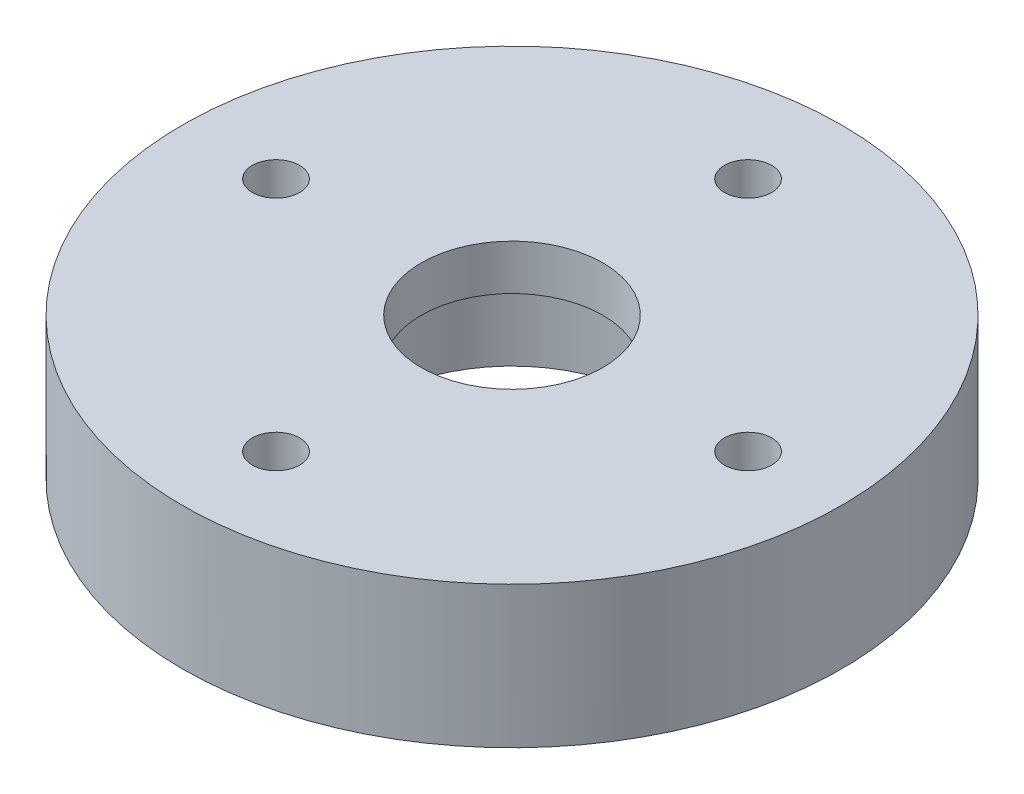
ISO-10303-21;
HEADER;
FILE_DESCRIPTION(('STEP AP214'),'2;1');
FILE_NAME('part.step','',(''),(''),'','','');
FILE_SCHEMA(('AUTOMOTIVE_DESIGN { 1 0 10303 214 1 1 1 1 }'));
ENDSEC;
DATA;
#1=APPLICATION_CONTEXT('core data for automotive mechanical design processes');
#2=APPLICATION_PROTOCOL_DEFINITION('international standard','automotive_design',2000,#1);
#3=PRODUCT_CONTEXT('',#1,'mechanical');
#4=PRODUCT('Part','Part','',(#3));
#5=PRODUCT_RELATED_PRODUCT_CATEGORY('part','',(#4));
#6=PRODUCT_DEFINITION_FORMATION('','',#4);
#7=PRODUCT_DEFINITION_CONTEXT('part definition',#1,'design');
#8=PRODUCT_DEFINITION('design','',#6,#7);
#9=PRODUCT_DEFINITION_SHAPE('','',#8);
#10=(LENGTH_UNIT() NAMED_UNIT(*) SI_UNIT(.MILLI.,.METRE.));
#11=(NAMED_UNIT(*) PLANE_ANGLE_UNIT() SI_UNIT($,.RADIAN.));
#12=(NAMED_UNIT(*) SI_UNIT($,.STERADIAN.) SOLID_ANGLE_UNIT());
#13=UNCERTAINTY_MEASURE_WITH_UNIT(LENGTH_MEASURE(1.E-05),#10,'distance_accuracy_value','');
#14=(GEOMETRIC_REPRESENTATION_CONTEXT(3) GLOBAL_UNCERTAINTY_ASSIGNED_CONTEXT((#13)) GLOBAL_UNIT_ASSIGNED_CONTEXT((#10,
#11,#12)) REPRESENTATION_CONTEXT('',''));
#15=CARTESIAN_POINT('',(0.,0.,0.));
#16=DIRECTION('',(0.,0.,1.));
#17=DIRECTION('',(1.,0.,0.));
#18=AXIS2_PLACEMENT_3D('',#15,#16,#17);
#19=CARTESIAN_POINT('',(0.,0.,0.));
#20=DIRECTION('',(0.,1.,0.));
#21=DIRECTION('',(0.,0.,1.));
#22=AXIS2_PLACEMENT_3D('',#19,#20,#21);
#23=PLANE('',#22);
#24=CARTESIAN_POINT('',(0.,0.,13.));
#25=DIRECTION('',(0.,1.,0.));
#26=DIRECTION('',(0.,0.,-1.));
#27=AXIS2_PLACEMENT_3D('',#24,#25,#26);
#28=CIRCLE('',#27,1.3);
#29=CARTESIAN_POINT('',(0.,0.,11.7));
#30=VERTEX_POINT('',#29);
#31=EDGE_CURVE('E70',#30,#30,#28,.T.);
#32=ORIENTED_EDGE('',*,*,#31,.T.);
#33=EDGE_LOOP('',(#32));
#34=FACE_BOUND('',#33,.T.);
#35=CARTESIAN_POINT('',(-13.,0.,-1.36167772214882E-13));
#36=DIRECTION('',(0.,1.,0.));
#37=DIRECTION('',(1.,0.,0.));
#38=AXIS2_PLACEMENT_3D('',#35,#36,#37);
#39=CIRCLE('',#38,1.3);
#40=CARTESIAN_POINT('',(-11.7,0.,-1.22550994993394E-13));
#41=VERTEX_POINT('',#40);
#42=EDGE_CURVE('E76',#41,#41,#39,.T.);
#43=ORIENTED_EDGE('',*,*,#42,.T.);
#44=EDGE_LOOP('',(#43));
#45=FACE_BOUND('',#44,.T.);
#46=CARTESIAN_POINT('',(13.,0.,0.));
#47=DIRECTION('',(0.,1.,0.));
#48=DIRECTION('',(-1.,0.,0.));
#49=AXIS2_PLACEMENT_3D('',#46,#47,#48);
#50=CIRCLE('',#49,1.3);
#51=CARTESIAN_POINT('',(11.7,0.,0.));
#52=VERTEX_POINT('',#51);
#53=EDGE_CURVE('E64',#52,#52,#50,.T.);
#54=ORIENTED_EDGE('',*,*,#53,.T.);
#55=EDGE_LOOP('',(#54));
#56=FACE_BOUND('',#55,.T.);
#57=CARTESIAN_POINT('',(0.,0.,-13.));
#58=DIRECTION('',(0.,1.,0.));
#59=DIRECTION('',(0.,0.,1.));
#60=AXIS2_PLACEMENT_3D('',#57,#58,#59);
#61=CIRCLE('',#60,1.3);
#62=CARTESIAN_POINT('',(0.,0.,-11.7));
#63=VERTEX_POINT('',#62);
#64=EDGE_CURVE('E58',#63,#63,#61,.T.);
#65=ORIENTED_EDGE('',*,*,#64,.T.);
#66=EDGE_LOOP('',(#65));
#67=FACE_BOUND('',#66,.T.);
#68=CARTESIAN_POINT('',(0.,0.,0.));
#69=DIRECTION('',(0.,1.,0.));
#70=DIRECTION('',(0.,0.,1.));
#71=AXIS2_PLACEMENT_3D('',#68,#69,#70);
#72=CIRCLE('',#71,18.15);
#73=CARTESIAN_POINT('',(0.,0.,18.15));
#74=VERTEX_POINT('',#73);
#75=EDGE_CURVE('E10',#74,#74,#72,.T.);
#76=ORIENTED_EDGE('',*,*,#75,.F.);
#77=EDGE_LOOP('',(#76));
#78=FACE_BOUND('',#77,.T.);
#79=CARTESIAN_POINT('',(0.,0.,0.));
#80=DIRECTION('',(0.,1.,0.));
#81=DIRECTION('',(0.,0.,1.));
#82=AXIS2_PLACEMENT_3D('',#79,#80,#81);
#83=CIRCLE('',#82,7.6);
#84=CARTESIAN_POINT('',(0.,0.,7.6));
#85=VERTEX_POINT('',#84);
#86=EDGE_CURVE('E41',#85,#85,#83,.T.);
#87=ORIENTED_EDGE('',*,*,#86,.T.);
#88=EDGE_LOOP('',(#87));
#89=FACE_BOUND('',#88,.T.);
#90=ADVANCED_FACE('F34',(#34,#45,#56,#67,#78,#89),#23,.F.);
#91=CARTESIAN_POINT('',(0.,5.3,0.));
#92=DIRECTION('',(0.,-1.,0.));
#93=DIRECTION('',(0.,0.,-1.));
#94=AXIS2_PLACEMENT_3D('',#91,#92,#93);
#95=CYLINDRICAL_SURFACE('',#94,18.15);
#96=ORIENTED_EDGE('',*,*,#75,.T.);
#97=EDGE_LOOP('',(#96));
#98=FACE_BOUND('',#97,.T.);
#99=CARTESIAN_POINT('',(0.,7.8,0.));
#100=DIRECTION('',(0.,-1.,0.));
#101=DIRECTION('',(0.,0.,-1.));
#102=AXIS2_PLACEMENT_3D('',#99,#100,#101);
#103=CIRCLE('',#102,18.15);
#104=CARTESIAN_POINT('',(0.,7.8,-18.15));
#105=VERTEX_POINT('',#104);
#106=EDGE_CURVE('E49',#105,#105,#103,.T.);
#107=ORIENTED_EDGE('',*,*,#106,.T.);
#108=EDGE_LOOP('',(#107));
#109=FACE_BOUND('',#108,.T.);
#110=ADVANCED_FACE('F36',(#98,#109),#95,.T.);
#111=CARTESIAN_POINT('',(0.,5.3,0.));
#112=DIRECTION('',(0.,-1.,0.));
#113=DIRECTION('',(0.,0.,-1.));
#114=AXIS2_PLACEMENT_3D('',#111,#112,#113);
#115=CYLINDRICAL_SURFACE('',#114,7.6);
#116=CARTESIAN_POINT('',(0.,5.3,0.));
#117=DIRECTION('',(0.,-1.,0.));
#118=DIRECTION('',(0.,0.,-1.));
#119=AXIS2_PLACEMENT_3D('',#116,#117,#118);
#120=CIRCLE('',#119,7.6);
#121=CARTESIAN_POINT('',(0.,5.3,-7.6));
#122=VERTEX_POINT('',#121);
#123=EDGE_CURVE('E45',#122,#122,#120,.T.);
#124=ORIENTED_EDGE('',*,*,#123,.F.);
#125=EDGE_LOOP('',(#124));
#126=FACE_BOUND('',#125,.T.);
#127=ORIENTED_EDGE('',*,*,#86,.F.);
#128=EDGE_LOOP('',(#127));
#129=FACE_BOUND('',#128,.T.);
#130=ADVANCED_FACE('F111',(#126,#129),#115,.F.);
#131=CARTESIAN_POINT('',(0.,5.3,0.));
#132=DIRECTION('',(0.,-1.,0.));
#133=DIRECTION('',(0.,0.,-1.));
#134=AXIS2_PLACEMENT_3D('',#131,#132,#133);
#135=PLANE('',#134);
#136=CARTESIAN_POINT('',(0.,5.3,0.));
#137=DIRECTION('',(0.,-1.,0.));
#138=DIRECTION('',(0.,0.,-1.));
#139=AXIS2_PLACEMENT_3D('',#136,#137,#138);
#140=CIRCLE('',#139,5.);
#141=CARTESIAN_POINT('',(0.,5.3,-5.));
#142=VERTEX_POINT('',#141);
#143=EDGE_CURVE('E55',#142,#142,#140,.T.);
#144=ORIENTED_EDGE('',*,*,#143,.F.);
#145=EDGE_LOOP('',(#144));
#146=FACE_BOUND('',#145,.T.);
#147=ORIENTED_EDGE('',*,*,#123,.T.);
#148=EDGE_LOOP('',(#147));
#149=FACE_BOUND('',#148,.T.);
#150=ADVANCED_FACE('F98',(#146,#149),#135,.T.);
#151=CARTESIAN_POINT('',(0.,7.8,0.));
#152=DIRECTION('',(0.,-1.,0.));
#153=DIRECTION('',(0.,0.,-1.));
#154=AXIS2_PLACEMENT_3D('',#151,#152,#153);
#155=PLANE('',#154);
#156=CARTESIAN_POINT('',(0.,7.8,13.));
#157=DIRECTION('',(0.,1.,0.));
#158=DIRECTION('',(0.,0.,-1.));
#159=AXIS2_PLACEMENT_3D('',#156,#157,#158);
#160=CIRCLE('',#159,1.3);
#161=CARTESIAN_POINT('',(0.,7.8,11.7));
#162=VERTEX_POINT('',#161);
#163=EDGE_CURVE('E79',#162,#162,#160,.T.);
#164=ORIENTED_EDGE('',*,*,#163,.F.);
#165=EDGE_LOOP('',(#164));
#166=FACE_BOUND('',#165,.T.);
#167=CARTESIAN_POINT('',(-13.,7.8,-1.36167772214882E-13));
#168=DIRECTION('',(0.,1.,0.));
#169=DIRECTION('',(1.,0.,0.));
#170=AXIS2_PLACEMENT_3D('',#167,#168,#169);
#171=CIRCLE('',#170,1.3);
#172=CARTESIAN_POINT('',(-11.7,7.8,-1.22550994993394E-13));
#173=VERTEX_POINT('',#172);
#174=EDGE_CURVE('E73',#173,#173,#171,.T.);
#175=ORIENTED_EDGE('',*,*,#174,.F.);
#176=EDGE_LOOP('',(#175));
#177=FACE_BOUND('',#176,.T.);
#178=CARTESIAN_POINT('',(13.,7.8,0.));
#179=DIRECTION('',(0.,1.,0.));
#180=DIRECTION('',(-1.,0.,0.));
#181=AXIS2_PLACEMENT_3D('',#178,#179,#180);
#182=CIRCLE('',#181,1.3);
#183=CARTESIAN_POINT('',(11.7,7.8,0.));
#184=VERTEX_POINT('',#183);
#185=EDGE_CURVE('E67',#184,#184,#182,.T.);
#186=ORIENTED_EDGE('',*,*,#185,.F.);
#187=EDGE_LOOP('',(#186));
#188=FACE_BOUND('',#187,.T.);
#189=CARTESIAN_POINT('',(0.,7.8,-13.));
#190=DIRECTION('',(0.,1.,0.));
#191=DIRECTION('',(0.,0.,1.));
#192=AXIS2_PLACEMENT_3D('',#189,#190,#191);
#193=CIRCLE('',#192,1.3);
#194=CARTESIAN_POINT('',(0.,7.8,-11.7));
#195=VERTEX_POINT('',#194);
#196=EDGE_CURVE('E61',#195,#195,#193,.T.);
#197=ORIENTED_EDGE('',*,*,#196,.F.);
#198=EDGE_LOOP('',(#197));
#199=FACE_BOUND('',#198,.T.);
#200=CARTESIAN_POINT('',(0.,7.8,0.));
#201=DIRECTION('',(0.,-1.,0.));
#202=DIRECTION('',(0.,0.,-1.));
#203=AXIS2_PLACEMENT_3D('',#200,#201,#202);
#204=CIRCLE('',#203,5.);
#205=CARTESIAN_POINT('',(0.,7.8,-5.));
#206=VERTEX_POINT('',#205);
#207=EDGE_CURVE('E54',#206,#206,#204,.T.);
#208=ORIENTED_EDGE('',*,*,#207,.T.);
#209=EDGE_LOOP('',(#208));
#210=FACE_BOUND('',#209,.T.);
#211=ORIENTED_EDGE('',*,*,#106,.F.);
#212=EDGE_LOOP('',(#211));
#213=FACE_BOUND('',#212,.T.);
#214=ADVANCED_FACE('F94',(#166,#177,#188,#199,#210,#213),#155,.F.);
#215=CARTESIAN_POINT('',(0.,7.8,0.));
#216=DIRECTION('',(0.,-1.,0.));
#217=DIRECTION('',(0.,0.,-1.));
#218=AXIS2_PLACEMENT_3D('',#215,#216,#217);
#219=CYLINDRICAL_SURFACE('',#218,5.);
#220=ORIENTED_EDGE('',*,*,#207,.F.);
#221=EDGE_LOOP('',(#220));
#222=FACE_BOUND('',#221,.T.);
#223=ORIENTED_EDGE('',*,*,#143,.T.);
#224=EDGE_LOOP('',(#223));
#225=FACE_BOUND('',#224,.T.);
#226=ADVANCED_FACE('F97',(#222,#225),#219,.F.);
#227=CARTESIAN_POINT('',(0.,0.,-13.));
#228=DIRECTION('',(0.,1.,0.));
#229=DIRECTION('',(0.,0.,1.));
#230=AXIS2_PLACEMENT_3D('',#227,#228,#229);
#231=CYLINDRICAL_SURFACE('',#230,1.3);
#232=ORIENTED_EDGE('',*,*,#64,.F.);
#233=EDGE_LOOP('',(#232));
#234=FACE_BOUND('',#233,.T.);
#235=ORIENTED_EDGE('',*,*,#196,.T.);
#236=EDGE_LOOP('',(#235));
#237=FACE_BOUND('',#236,.T.);
#238=ADVANCED_FACE('F126',(#234,#237),#231,.F.);
#239=CARTESIAN_POINT('',(13.,0.,0.));
#240=DIRECTION('',(0.,1.,0.));
#241=DIRECTION('',(0.,0.,1.));
#242=AXIS2_PLACEMENT_3D('',#239,#240,#241);
#243=CYLINDRICAL_SURFACE('',#242,1.3);
#244=ORIENTED_EDGE('',*,*,#53,.F.);
#245=EDGE_LOOP('',(#244));
#246=FACE_BOUND('',#245,.T.);
#247=ORIENTED_EDGE('',*,*,#185,.T.);
#248=EDGE_LOOP('',(#247));
#249=FACE_BOUND('',#248,.T.);
#250=ADVANCED_FACE('F130',(#246,#249),#243,.F.);
#251=CARTESIAN_POINT('',(-13.,0.,-1.36167772214882E-13));
#252=DIRECTION('',(0.,1.,0.));
#253=DIRECTION('',(0.,0.,1.));
#254=AXIS2_PLACEMENT_3D('',#251,#252,#253);
#255=CYLINDRICAL_SURFACE('',#254,1.3);
#256=ORIENTED_EDGE('',*,*,#42,.F.);
#257=EDGE_LOOP('',(#256));
#258=FACE_BOUND('',#257,.T.);
#259=ORIENTED_EDGE('',*,*,#174,.T.);
#260=EDGE_LOOP('',(#259));
#261=FACE_BOUND('',#260,.T.);
#262=ADVANCED_FACE('F90',(#258,#261),#255,.F.);
#263=CARTESIAN_POINT('',(0.,0.,13.));
#264=DIRECTION('',(0.,1.,0.));
#265=DIRECTION('',(0.,0.,1.));
#266=AXIS2_PLACEMENT_3D('',#263,#264,#265);
#267=CYLINDRICAL_SURFACE('',#266,1.3);
#268=ORIENTED_EDGE('',*,*,#31,.F.);
#269=EDGE_LOOP('',(#268));
#270=FACE_BOUND('',#269,.T.);
#271=ORIENTED_EDGE('',*,*,#163,.T.);
#272=EDGE_LOOP('',(#271));
#273=FACE_BOUND('',#272,.T.);
#274=ADVANCED_FACE('F87',(#270,#273),#267,.F.);
#275=CLOSED_SHELL('',(#90,#110,#130,#150,#214,#226,#238,#250,#262,#274));
#276=MANIFOLD_SOLID_BREP('B2',#275);
#277=ADVANCED_BREP_SHAPE_REPRESENTATION('',(#18,#276),#14);
#278=SHAPE_DEFINITION_REPRESENTATION(#9,#277);
ENDSEC;
END-ISO-10303-21;
